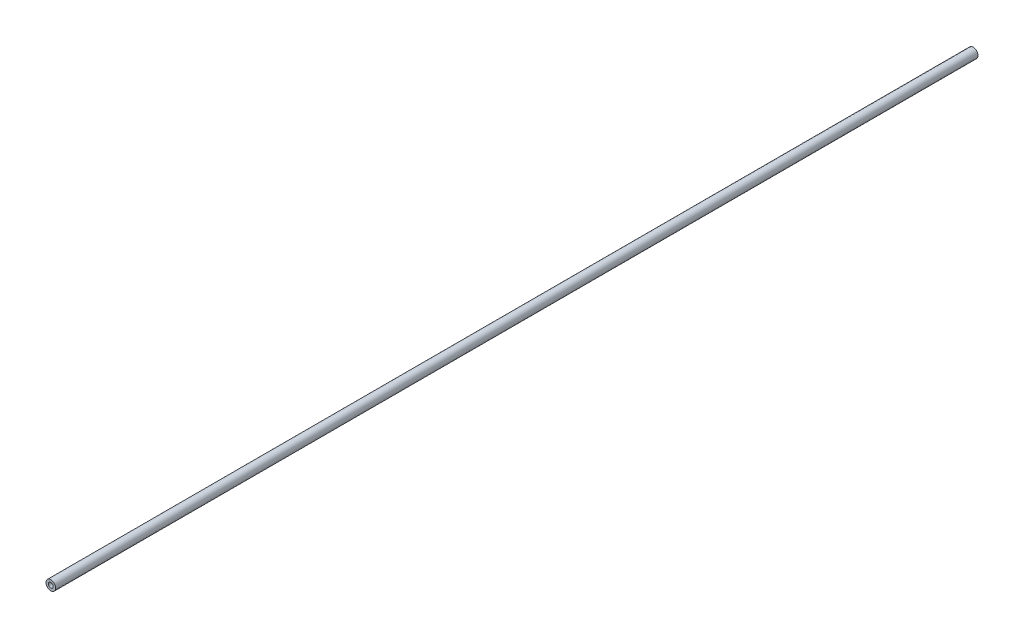
ISO-10303-21;
HEADER;
FILE_DESCRIPTION(('STEP AP214'),'2;1');
FILE_NAME('part.step','',(''),(''),'','','');
FILE_SCHEMA(('AUTOMOTIVE_DESIGN { 1 0 10303 214 1 1 1 1 }'));
ENDSEC;
DATA;
#1=APPLICATION_CONTEXT('core data for automotive mechanical design processes');
#2=APPLICATION_PROTOCOL_DEFINITION('international standard','automotive_design',2000,#1);
#3=PRODUCT_CONTEXT('',#1,'mechanical');
#4=PRODUCT('Part','Part','',(#3));
#5=PRODUCT_RELATED_PRODUCT_CATEGORY('part','',(#4));
#6=PRODUCT_DEFINITION_FORMATION('','',#4);
#7=PRODUCT_DEFINITION_CONTEXT('part definition',#1,'design');
#8=PRODUCT_DEFINITION('design','',#6,#7);
#9=PRODUCT_DEFINITION_SHAPE('','',#8);
#10=(LENGTH_UNIT() NAMED_UNIT(*) SI_UNIT(.MILLI.,.METRE.));
#11=(NAMED_UNIT(*) PLANE_ANGLE_UNIT() SI_UNIT($,.RADIAN.));
#12=(NAMED_UNIT(*) SI_UNIT($,.STERADIAN.) SOLID_ANGLE_UNIT());
#13=UNCERTAINTY_MEASURE_WITH_UNIT(LENGTH_MEASURE(1.E-05),#10,'distance_accuracy_value','');
#14=(GEOMETRIC_REPRESENTATION_CONTEXT(3) GLOBAL_UNCERTAINTY_ASSIGNED_CONTEXT((#13)) GLOBAL_UNIT_ASSIGNED_CONTEXT((#10,
#11,#12)) REPRESENTATION_CONTEXT('',''));
#15=CARTESIAN_POINT('',(0.,0.,0.));
#16=DIRECTION('',(0.,0.,1.));
#17=DIRECTION('',(1.,0.,0.));
#18=AXIS2_PLACEMENT_3D('',#15,#16,#17);
#19=CARTESIAN_POINT('',(0.,0.,485.14));
#20=DIRECTION('',(0.,0.,1.));
#21=DIRECTION('',(1.,0.,0.));
#22=AXIS2_PLACEMENT_3D('',#19,#20,#21);
#23=PLANE('',#22);
#24=CARTESIAN_POINT('',(0.,0.,485.14));
#25=DIRECTION('',(0.,0.,1.));
#26=DIRECTION('',(1.,0.,0.));
#27=AXIS2_PLACEMENT_3D('',#24,#25,#26);
#28=CIRCLE('',#27,2.54);
#29=CARTESIAN_POINT('',(2.54,0.,485.14));
#30=VERTEX_POINT('',#29);
#31=EDGE_CURVE('E10',#30,#30,#28,.T.);
#32=ORIENTED_EDGE('',*,*,#31,.T.);
#33=EDGE_LOOP('',(#32));
#34=FACE_BOUND('',#33,.T.);
#35=CARTESIAN_POINT('',(0.,0.,485.14));
#36=DIRECTION('',(0.,0.,1.));
#37=DIRECTION('',(1.,0.,0.));
#38=AXIS2_PLACEMENT_3D('',#35,#36,#37);
#39=CIRCLE('',#38,1.27);
#40=CARTESIAN_POINT('',(1.27,0.,485.14));
#41=VERTEX_POINT('',#40);
#42=EDGE_CURVE('E48',#41,#41,#39,.T.);
#43=ORIENTED_EDGE('',*,*,#42,.F.);
#44=EDGE_LOOP('',(#43));
#45=FACE_BOUND('',#44,.T.);
#46=ADVANCED_FACE('F35',(#34,#45),#23,.T.);
#47=CARTESIAN_POINT('',(0.,0.,0.));
#48=DIRECTION('',(0.,0.,1.));
#49=DIRECTION('',(1.,0.,0.));
#50=AXIS2_PLACEMENT_3D('',#47,#48,#49);
#51=PLANE('',#50);
#52=CARTESIAN_POINT('',(0.,0.,0.));
#53=DIRECTION('',(0.,0.,1.));
#54=DIRECTION('',(1.,0.,0.));
#55=AXIS2_PLACEMENT_3D('',#52,#53,#54);
#56=CIRCLE('',#55,2.54);
#57=CARTESIAN_POINT('',(2.54,0.,0.));
#58=VERTEX_POINT('',#57);
#59=EDGE_CURVE('E39',#58,#58,#56,.T.);
#60=ORIENTED_EDGE('',*,*,#59,.F.);
#61=EDGE_LOOP('',(#60));
#62=FACE_BOUND('',#61,.T.);
#63=CARTESIAN_POINT('',(0.,0.,0.));
#64=DIRECTION('',(0.,0.,1.));
#65=DIRECTION('',(1.,0.,0.));
#66=AXIS2_PLACEMENT_3D('',#63,#64,#65);
#67=CIRCLE('',#66,1.27);
#68=CARTESIAN_POINT('',(1.27,0.,0.));
#69=VERTEX_POINT('',#68);
#70=EDGE_CURVE('E50',#69,#69,#67,.T.);
#71=ORIENTED_EDGE('',*,*,#70,.T.);
#72=EDGE_LOOP('',(#71));
#73=FACE_BOUND('',#72,.T.);
#74=ADVANCED_FACE('F62',(#62,#73),#51,.F.);
#75=CARTESIAN_POINT('',(0.,0.,485.14));
#76=DIRECTION('',(0.,0.,-1.));
#77=DIRECTION('',(-1.,0.,0.));
#78=AXIS2_PLACEMENT_3D('',#75,#76,#77);
#79=CYLINDRICAL_SURFACE('',#78,2.54);
#80=ORIENTED_EDGE('',*,*,#31,.F.);
#81=EDGE_LOOP('',(#80));
#82=FACE_BOUND('',#81,.T.);
#83=ORIENTED_EDGE('',*,*,#59,.T.);
#84=EDGE_LOOP('',(#83));
#85=FACE_BOUND('',#84,.T.);
#86=ADVANCED_FACE('F37',(#82,#85),#79,.T.);
#87=CARTESIAN_POINT('',(0.,0.,485.14));
#88=DIRECTION('',(0.,0.,-1.));
#89=DIRECTION('',(-1.,0.,0.));
#90=AXIS2_PLACEMENT_3D('',#87,#88,#89);
#91=CYLINDRICAL_SURFACE('',#90,1.27);
#92=ORIENTED_EDGE('',*,*,#42,.T.);
#93=EDGE_LOOP('',(#92));
#94=FACE_BOUND('',#93,.T.);
#95=ORIENTED_EDGE('',*,*,#70,.F.);
#96=EDGE_LOOP('',(#95));
#97=FACE_BOUND('',#96,.T.);
#98=ADVANCED_FACE('F58',(#94,#97),#91,.F.);
#99=CLOSED_SHELL('',(#46,#74,#86,#98));
#100=MANIFOLD_SOLID_BREP('B2',#99);
#101=ADVANCED_BREP_SHAPE_REPRESENTATION('',(#18,#100),#14);
#102=SHAPE_DEFINITION_REPRESENTATION(#9,#101);
ENDSEC;
END-ISO-10303-21;
